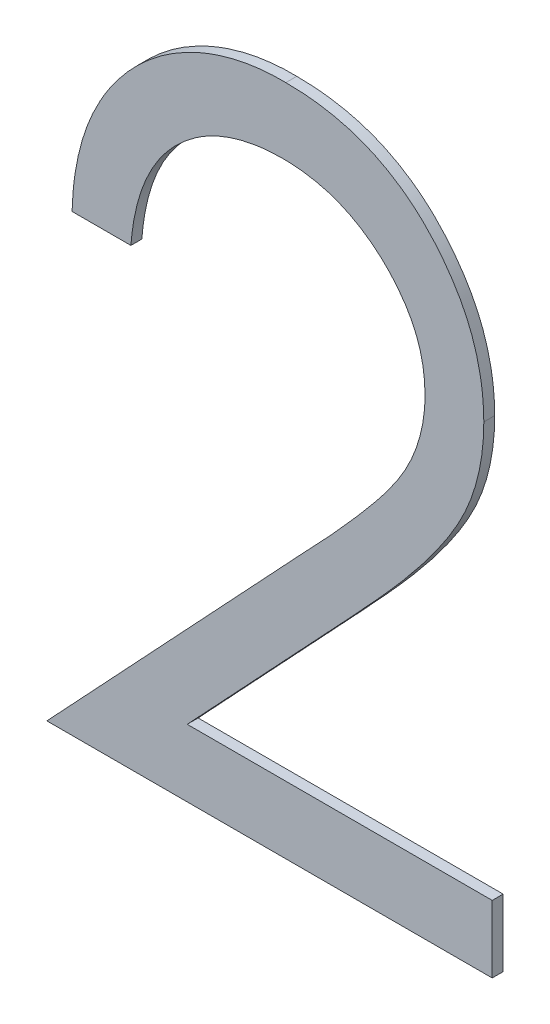
ISO-10303-21;
HEADER;
FILE_DESCRIPTION(('STEP AP214'),'2;1');
FILE_NAME('part.step','',(''),(''),'','','');
FILE_SCHEMA(('AUTOMOTIVE_DESIGN { 1 0 10303 214 1 1 1 1 }'));
ENDSEC;
DATA;
#1=APPLICATION_CONTEXT('core data for automotive mechanical design processes');
#2=APPLICATION_PROTOCOL_DEFINITION('international standard','automotive_design',2000,#1);
#3=PRODUCT_CONTEXT('',#1,'mechanical');
#4=PRODUCT('Part','Part','',(#3));
#5=PRODUCT_RELATED_PRODUCT_CATEGORY('part','',(#4));
#6=PRODUCT_DEFINITION_FORMATION('','',#4);
#7=PRODUCT_DEFINITION_CONTEXT('part definition',#1,'design');
#8=PRODUCT_DEFINITION('design','',#6,#7);
#9=PRODUCT_DEFINITION_SHAPE('','',#8);
#10=(LENGTH_UNIT() NAMED_UNIT(*) SI_UNIT(.MILLI.,.METRE.));
#11=(NAMED_UNIT(*) PLANE_ANGLE_UNIT() SI_UNIT($,.RADIAN.));
#12=(NAMED_UNIT(*) SI_UNIT($,.STERADIAN.) SOLID_ANGLE_UNIT());
#13=UNCERTAINTY_MEASURE_WITH_UNIT(LENGTH_MEASURE(1.E-05),#10,'distance_accuracy_value','');
#14=(GEOMETRIC_REPRESENTATION_CONTEXT(3) GLOBAL_UNCERTAINTY_ASSIGNED_CONTEXT((#13)) GLOBAL_UNIT_ASSIGNED_CONTEXT((#10,
#11,#12)) REPRESENTATION_CONTEXT('',''));
#15=CARTESIAN_POINT('',(0.,0.,0.));
#16=DIRECTION('',(0.,0.,1.));
#17=DIRECTION('',(1.,0.,0.));
#18=AXIS2_PLACEMENT_3D('',#15,#16,#17);
#19=CARTESIAN_POINT('',(0.484675480769231,0.914268571545005,0.551));
#20=CARTESIAN_POINT('',(0.484675480769231,0.914268571545005,0.55));
#21=CARTESIAN_POINT('',(0.484206266493408,0.914256313849051,0.551));
#22=CARTESIAN_POINT('',(0.484206266493408,0.914256313849051,0.55));
#23=CARTESIAN_POINT('',(0.483284807129645,0.91423224175812,0.551));
#24=CARTESIAN_POINT('',(0.483284807129645,0.91423224175812,0.55));
#25=CARTESIAN_POINT('',(0.481931909422161,0.914063853232542,0.551));
#26=CARTESIAN_POINT('',(0.481931909422161,0.914063853232542,0.55));
#27=CARTESIAN_POINT('',(0.48064129609318,0.913773353111452,0.551));
#28=CARTESIAN_POINT('',(0.48064129609318,0.913773353111452,0.55));
#29=CARTESIAN_POINT('',(0.479409720613987,0.913376038693388,0.551));
#30=CARTESIAN_POINT('',(0.479409720613987,0.913376038693388,0.55));
#31=CARTESIAN_POINT('',(0.478235099142912,0.912871034999291,0.551));
#32=CARTESIAN_POINT('',(0.478235099142912,0.912871034999291,0.55));
#33=CARTESIAN_POINT('',(0.477123144102272,0.912242033661941,0.551));
#34=CARTESIAN_POINT('',(0.477123144102272,0.912242033661941,0.55));
#35=CARTESIAN_POINT('',(0.476076351714959,0.911491459493612,0.551));
#36=CARTESIAN_POINT('',(0.476076351714959,0.911491459493612,0.55));
#37=CARTESIAN_POINT('',(0.475092754171894,0.910640478528057,0.551));
#38=CARTESIAN_POINT('',(0.475092754171894,0.910640478528057,0.55));
#39=CARTESIAN_POINT('',(0.474186514530805,0.909693033935784,0.551));
#40=CARTESIAN_POINT('',(0.474186514530805,0.909693033935784,0.55));
#41=CARTESIAN_POINT('',(0.47339028237312,0.90863686314035,0.551));
#42=CARTESIAN_POINT('',(0.47339028237312,0.90863686314035,0.55));
#43=CARTESIAN_POINT('',(0.472694556416373,0.907491250305418,0.551));
#44=CARTESIAN_POINT('',(0.472694556416373,0.907491250305418,0.55));
#45=CARTESIAN_POINT('',(0.47208754098529,0.906259286581371,0.550999999999999));
#46=CARTESIAN_POINT('',(0.47208754098529,0.906259286581371,0.549999999999999));
#47=CARTESIAN_POINT('',(0.471594586298157,0.904929793210208,0.551));
#48=CARTESIAN_POINT('',(0.471594586298157,0.904929793210208,0.55));
#49=CARTESIAN_POINT('',(0.471217903719338,0.90350748969852,0.551));
#50=CARTESIAN_POINT('',(0.471217903719338,0.90350748969852,0.55));
#51=CARTESIAN_POINT('',(0.470919843489825,0.901998551731002,0.551));
#52=CARTESIAN_POINT('',(0.470919843489825,0.901998551731002,0.55));
#53=CARTESIAN_POINT('',(0.470820268850884,0.90095652170489,0.551));
#54=CARTESIAN_POINT('',(0.470820268850884,0.90095652170489,0.55));
#55=CARTESIAN_POINT('',(0.470769230769231,0.900422417698851,0.551));
#56=CARTESIAN_POINT('',(0.470769230769231,0.900422417698851,0.55));
#57=B_SPLINE_SURFACE_WITH_KNOTS('',3,1,((#19,#20),(#21,#22),(#23,#24),(#25,#26),(#27,#28),(#29,
#30),(#31,#32),(#33,#34),(#35,#36),(#37,#38),(#39,#40),(#41,#42),(#43,#44),(#45,#46),(#47,#48),
(#49,#50),(#51,#52),(#53,#54),(#55,#56)),.UNSPECIFIED.,.F.,.F.,.F.,(4,1,1,1,1,1,1,1,1,1,1,1,1,1,
1,1,4),(2,2),(0.,0.0644386715952427,0.126546911271678,0.18688715343657,0.245877535589456,
0.304040884691268,0.362191218072659,0.420975932791646,0.480660283279666,0.540600274953759,
0.600689098349453,0.661935789757197,0.724442505913982,0.789038393881747,0.856313757050996,
0.926352028205863,1.),(0.,1.),.UNSPECIFIED.);
#58=CARTESIAN_POINT('',(0.484675480769231,0.914268571545005,0.549999999999998));
#59=CARTESIAN_POINT('',(0.484203213522581,0.914267831626176,0.549999999999998));
#60=CARTESIAN_POINT('',(0.483728933854455,0.9142480235491,0.549999999999998));
#61=CARTESIAN_POINT('',(0.481940146008268,0.914094619778343,0.549999999999998));
#62=CARTESIAN_POINT('',(0.480632701686934,0.91382124393103,0.549999999999999));
#63=CARTESIAN_POINT('',(0.478242592816631,0.91290938988838,0.549999999999999));
#64=CARTESIAN_POINT('',(0.477150992976622,0.91229475794108,0.549999999999999));
#65=CARTESIAN_POINT('',(0.475179069399388,0.910777096121196,0.549999999999999));
#66=CARTESIAN_POINT('',(0.474300320216442,0.909872025614639,0.549999999999999));
#67=CARTESIAN_POINT('',(0.472859067562755,0.907869027604336,0.550000000000001));
#68=CARTESIAN_POINT('',(0.472290285058833,0.906775570241275,0.550000000000002));
#69=CARTESIAN_POINT('',(0.471422518452948,0.904462672246368,0.550000000000002));
#70=CARTESIAN_POINT('',(0.471130491261301,0.903240800049967,0.550000000000002));
#71=CARTESIAN_POINT('',(0.470869153336606,0.901479061632357,0.550000000000003));
#72=CARTESIAN_POINT('',(0.470810823615498,0.900950547517057,0.550000000000004));
#73=CARTESIAN_POINT('',(0.470769230769231,0.90042241769885,0.550000000000004));
#74=B_SPLINE_CURVE_WITH_KNOTS('',3,(#58,#59,#60,#61,#62,#63,#64,#65,#66,#67,#68,#69,#70,#71,#72,
#73),.UNSPECIFIED.,.F.,.F.,(4,2,2,2,2,2,2,4),(0.,0.00142109215084824,0.00537166617766003,
0.00907573030699463,0.0128064111152645,0.0164584082801213,0.0201999460873375,
0.0217925649659397),.UNSPECIFIED.);
#75=CARTESIAN_POINT('',(0.484675480769231,0.914268571545005,0.55));
#76=VERTEX_POINT('',#75);
#77=CARTESIAN_POINT('',(0.470769230769231,0.900422417698851,0.55));
#78=VERTEX_POINT('',#77);
#79=EDGE_CURVE('E11',#76,#78,#74,.T.);
#80=DIRECTION('',(0.,0.,-1.));
#81=VECTOR('',#80,1.);
#82=CARTESIAN_POINT('',(0.484675480769231,0.914268571545005,0.551));
#83=LINE('',#82,#81);
#84=CARTESIAN_POINT('',(0.484675480769231,0.914268571545005,0.551));
#85=VERTEX_POINT('',#84);
#86=EDGE_CURVE('E223',#85,#76,#83,.T.);
#87=CARTESIAN_POINT('',(0.484675480769231,0.914268571545005,0.550999999999998));
#88=CARTESIAN_POINT('',(0.484203213522581,0.914267831626176,0.550999999999998));
#89=CARTESIAN_POINT('',(0.483728933854455,0.9142480235491,0.550999999999998));
#90=CARTESIAN_POINT('',(0.481940146008268,0.914094619778343,0.550999999999998));
#91=CARTESIAN_POINT('',(0.480632701686934,0.91382124393103,0.550999999999999));
#92=CARTESIAN_POINT('',(0.478242592816631,0.91290938988838,0.550999999999999));
#93=CARTESIAN_POINT('',(0.477150992976622,0.91229475794108,0.550999999999999));
#94=CARTESIAN_POINT('',(0.475179069399388,0.910777096121196,0.550999999999999));
#95=CARTESIAN_POINT('',(0.474300320216442,0.909872025614639,0.551));
#96=CARTESIAN_POINT('',(0.472859067562755,0.907869027604336,0.551));
#97=CARTESIAN_POINT('',(0.472290285058833,0.906775570241275,0.551));
#98=CARTESIAN_POINT('',(0.471422518452948,0.904462672246368,0.551000000000001));
#99=CARTESIAN_POINT('',(0.471130491261301,0.903240800049967,0.551000000000002));
#100=CARTESIAN_POINT('',(0.470869153336606,0.901479061632357,0.551000000000003));
#101=CARTESIAN_POINT('',(0.470810823615498,0.900950547517057,0.551000000000004));
#102=CARTESIAN_POINT('',(0.470769230769231,0.90042241769885,0.551000000000004));
#103=B_SPLINE_CURVE_WITH_KNOTS('',3,(#87,#88,#89,#90,#91,#92,#93,#94,#95,#96,#97,#98,#99,#100,
#101,#102),.UNSPECIFIED.,.F.,.F.,(4,2,2,2,2,2,2,4),(0.,0.00142109215084824,0.00537166617766003,
0.00907573030699463,0.0128064111152645,0.0164584082801213,0.0201999460873375,
0.0217925649659397),.UNSPECIFIED.);
#104=CARTESIAN_POINT('',(0.470769230769231,0.900422417698851,0.551));
#105=VERTEX_POINT('',#104);
#106=EDGE_CURVE('E228',#85,#105,#103,.T.);
#107=DIRECTION('',(0.,0.,-1.));
#108=VECTOR('',#107,1.);
#109=CARTESIAN_POINT('',(0.470769230769231,0.900422417698851,0.551));
#110=LINE('',#109,#108);
#111=EDGE_CURVE('E129',#105,#78,#110,.T.);
#112=ORIENTED_EDGE('',*,*,#79,.F.);
#113=ORIENTED_EDGE('',*,*,#86,.F.);
#114=ORIENTED_EDGE('',*,*,#106,.T.);
#115=ORIENTED_EDGE('',*,*,#111,.T.);
#116=EDGE_LOOP('',(#112,#113,#114,#115));
#117=FACE_BOUND('',#116,.T.);
#118=ADVANCED_FACE('F17',(#117),#57,.T.);
#119=CARTESIAN_POINT('',(0.497692307692308,0.902105110006543,0.551));
#120=CARTESIAN_POINT('',(0.497692307692308,0.902105110006543,0.55));
#121=CARTESIAN_POINT('',(0.497681409252889,0.902514505407871,0.551));
#122=CARTESIAN_POINT('',(0.497681409252889,0.902514505407871,0.55));
#123=CARTESIAN_POINT('',(0.497659930521605,0.90332134512835,0.551));
#124=CARTESIAN_POINT('',(0.497659930521605,0.90332134512835,0.55));
#125=CARTESIAN_POINT('',(0.49747036999314,0.904504300997242,0.551));
#126=CARTESIAN_POINT('',(0.49747036999314,0.904504300997242,0.55));
#127=CARTESIAN_POINT('',(0.497183904174377,0.905645412091226,0.551));
#128=CARTESIAN_POINT('',(0.497183904174377,0.905645412091226,0.55));
#129=CARTESIAN_POINT('',(0.496773414036412,0.906748188418961,0.551));
#130=CARTESIAN_POINT('',(0.496773414036412,0.906748188418961,0.55));
#131=CARTESIAN_POINT('',(0.496231584206378,0.907801542454381,0.551));
#132=CARTESIAN_POINT('',(0.496231584206378,0.907801542454381,0.55));
#133=CARTESIAN_POINT('',(0.495572040550647,0.908806756400728,0.551));
#134=CARTESIAN_POINT('',(0.495572040550647,0.908806756400728,0.55));
#135=CARTESIAN_POINT('',(0.494811068034913,0.90977856723273,0.551));
#136=CARTESIAN_POINT('',(0.494811068034913,0.90977856723273,0.55));
#137=CARTESIAN_POINT('',(0.493930760560669,0.910689766628011,0.551));
#138=CARTESIAN_POINT('',(0.493930760560669,0.910689766628011,0.55));
#139=CARTESIAN_POINT('',(0.492963705935413,0.911524301579138,0.551));
#140=CARTESIAN_POINT('',(0.492963705935413,0.911524301579138,0.55));
#141=CARTESIAN_POINT('',(0.491942090228238,0.912263571614814,0.551));
#142=CARTESIAN_POINT('',(0.491942090228238,0.912263571614814,0.55));
#143=CARTESIAN_POINT('',(0.490861231298068,0.912881384942793,0.551));
#144=CARTESIAN_POINT('',(0.490861231298068,0.912881384942793,0.55));
#145=CARTESIAN_POINT('',(0.489725686346483,0.913387844894458,0.551));
#146=CARTESIAN_POINT('',(0.489725686346483,0.913387844894458,0.55));
#147=CARTESIAN_POINT('',(0.488538621156625,0.913785137143538,0.551));
#148=CARTESIAN_POINT('',(0.488538621156625,0.913785137143538,0.55));
#149=CARTESIAN_POINT('',(0.48729773981167,0.914060427076506,0.551));
#150=CARTESIAN_POINT('',(0.48729773981167,0.914060427076506,0.55));
#151=CARTESIAN_POINT('',(0.486006470961113,0.914233269658448,0.551));
#152=CARTESIAN_POINT('',(0.486006470961113,0.914233269658448,0.55));
#153=CARTESIAN_POINT('',(0.48512475389213,0.914256655462591,0.551));
#154=CARTESIAN_POINT('',(0.48512475389213,0.914256655462591,0.55));
#155=CARTESIAN_POINT('',(0.484675480769231,0.914268571545005,0.551));
#156=CARTESIAN_POINT('',(0.484675480769231,0.914268571545005,0.55));
#157=B_SPLINE_SURFACE_WITH_KNOTS('',3,1,((#119,#120),(#121,#122),(#123,#124),(#125,#126),(#127,
#128),(#129,#130),(#131,#132),(#133,#134),(#135,#136),(#137,#138),(#139,#140),(#141,#142),(#143,
#144),(#145,#146),(#147,#148),(#149,#150),(#151,#152),(#153,#154),(#155,#156)),.UNSPECIFIED.,
.F.,.F.,.F.,(4,1,1,1,1,1,1,1,1,1,1,1,1,1,1,1,4),(2,2),(0.,0.0619654006870592,0.122121905638293,
0.180988496849838,0.2399332164519,0.299905831106523,0.359988847476984,0.421775741741647,
0.486575826421125,0.551534804619738,0.615017542759979,0.677258616661657,0.739729962362713,
0.803050102662949,0.866495132015698,0.931973474177148,1.),(0.,1.),.UNSPECIFIED.);
#158=CARTESIAN_POINT('',(0.497692307692308,0.902105110006543,0.550000000000003));
#159=CARTESIAN_POINT('',(0.497692501527364,0.902516974964914,0.550000000000003));
#160=CARTESIAN_POINT('',(0.497672377490097,0.902930660970146,0.550000000000003));
#161=CARTESIAN_POINT('',(0.497523116595974,0.904421018505221,0.550000000000003));
#162=CARTESIAN_POINT('',(0.49727041130824,0.905489414090464,0.550000000000002));
#163=CARTESIAN_POINT('',(0.496442124999117,0.907498531656379,0.550000000000001));
#164=CARTESIAN_POINT('',(0.495864125908815,0.908438231160685,0.550000000000001));
#165=CARTESIAN_POINT('',(0.494426013403723,0.910248801725126,0.549999999999999));
#166=CARTESIAN_POINT('',(0.493541015531758,0.911099166281303,0.549999999999999));
#167=CARTESIAN_POINT('',(0.491548616046052,0.912542452305651,0.549999999999999));
#168=CARTESIAN_POINT('',(0.490437356963885,0.913130250006775,0.55));
#169=CARTESIAN_POINT('',(0.488531186719328,0.913789630310478,0.549999999999999));
#170=CARTESIAN_POINT('',(0.487772424589085,0.91397191085067,0.549999999999998));
#171=CARTESIAN_POINT('',(0.486233163717163,0.914210583364619,0.549999999999997));
#172=CARTESIAN_POINT('',(0.485452623907423,0.914266718561469,0.549999999999997));
#173=CARTESIAN_POINT('',(0.484675480769231,0.914268571545005,0.549999999999998));
#174=B_SPLINE_CURVE_WITH_KNOTS('',3,(#158,#159,#160,#161,#162,#163,#164,#165,#166,#167,#168,
#169,#170,#171,#172,#173),.UNSPECIFIED.,.F.,.F.,(4,2,2,2,2,2,2,4),(0.,0.00123933239544057,
0.00448020756953758,0.00774549814606912,0.0113881694826965,0.0150991126148403,
0.0174292216016311,0.0197640693941652),.UNSPECIFIED.);
#175=CARTESIAN_POINT('',(0.497692307692308,0.902105110006543,0.55));
#176=VERTEX_POINT('',#175);
#177=EDGE_CURVE('E32',#176,#76,#174,.T.);
#178=DIRECTION('',(0.,0.,-1.));
#179=VECTOR('',#178,1.);
#180=CARTESIAN_POINT('',(0.497692307692308,0.902105110006543,0.551));
#181=LINE('',#180,#179);
#182=CARTESIAN_POINT('',(0.497692307692308,0.902105110006543,0.551));
#183=VERTEX_POINT('',#182);
#184=EDGE_CURVE('E226',#183,#176,#181,.T.);
#185=CARTESIAN_POINT('',(0.497692307692308,0.902105110006543,0.551000000000003));
#186=CARTESIAN_POINT('',(0.497692501527364,0.902516974964914,0.551000000000003));
#187=CARTESIAN_POINT('',(0.497672377490097,0.902930660970146,0.551000000000003));
#188=CARTESIAN_POINT('',(0.497523116595974,0.904421018505221,0.551000000000003));
#189=CARTESIAN_POINT('',(0.49727041130824,0.905489414090464,0.551000000000002));
#190=CARTESIAN_POINT('',(0.496442124999117,0.907498531656379,0.551000000000001));
#191=CARTESIAN_POINT('',(0.495864125908815,0.908438231160685,0.551));
#192=CARTESIAN_POINT('',(0.494426013403723,0.910248801725126,0.550999999999999));
#193=CARTESIAN_POINT('',(0.493541015531758,0.911099166281303,0.550999999999999));
#194=CARTESIAN_POINT('',(0.491548616046052,0.912542452305651,0.550999999999999));
#195=CARTESIAN_POINT('',(0.490437356963885,0.913130250006775,0.551));
#196=CARTESIAN_POINT('',(0.488531186719328,0.913789630310478,0.550999999999998));
#197=CARTESIAN_POINT('',(0.487772424589085,0.91397191085067,0.550999999999998));
#198=CARTESIAN_POINT('',(0.486233163717163,0.914210583364619,0.550999999999997));
#199=CARTESIAN_POINT('',(0.485452623907423,0.914266718561469,0.550999999999997));
#200=CARTESIAN_POINT('',(0.484675480769231,0.914268571545005,0.550999999999998));
#201=B_SPLINE_CURVE_WITH_KNOTS('',3,(#185,#186,#187,#188,#189,#190,#191,#192,#193,#194,#195,
#196,#197,#198,#199,#200),.UNSPECIFIED.,.F.,.F.,(4,2,2,2,2,2,2,4),(0.,0.00123933239544057,
0.00448020756953758,0.00774549814606912,0.0113881694826965,0.0150991126148403,
0.0174292216016311,0.0197640693941652),.UNSPECIFIED.);
#202=EDGE_CURVE('E242',#183,#85,#201,.T.);
#203=ORIENTED_EDGE('',*,*,#177,.F.);
#204=ORIENTED_EDGE('',*,*,#184,.F.);
#205=ORIENTED_EDGE('',*,*,#202,.T.);
#206=ORIENTED_EDGE('',*,*,#86,.T.);
#207=EDGE_LOOP('',(#203,#204,#205,#206));
#208=FACE_BOUND('',#207,.T.);
#209=ADVANCED_FACE('F187',(#208),#157,.T.);
#210=CARTESIAN_POINT('',(0.486346153846154,0.88371568692962,0.551));
#211=CARTESIAN_POINT('',(0.486346153846154,0.88371568692962,0.55));
#212=CARTESIAN_POINT('',(0.486912689048574,0.884307086470453,0.551));
#213=CARTESIAN_POINT('',(0.486912689048574,0.884307086470453,0.55));
#214=CARTESIAN_POINT('',(0.488000887227755,0.885443043955096,0.551));
#215=CARTESIAN_POINT('',(0.488000887227755,0.885443043955096,0.55));
#216=CARTESIAN_POINT('',(0.489540017115913,0.887101494700251,0.551));
#217=CARTESIAN_POINT('',(0.489540017115913,0.887101494700251,0.55));
#218=CARTESIAN_POINT('',(0.490922399772697,0.888640058256002,0.551));
#219=CARTESIAN_POINT('',(0.490922399772697,0.888640058256002,0.55));
#220=CARTESIAN_POINT('',(0.492156983648786,0.890055827657907,0.551));
#221=CARTESIAN_POINT('',(0.492156983648786,0.890055827657907,0.55));
#222=CARTESIAN_POINT('',(0.493216986597914,0.891369511677259,0.551));
#223=CARTESIAN_POINT('',(0.493216986597914,0.891369511677259,0.55));
#224=CARTESIAN_POINT('',(0.494157653431305,0.892538563738763,0.551));
#225=CARTESIAN_POINT('',(0.494157653431305,0.892538563738763,0.55));
#226=CARTESIAN_POINT('',(0.494911349276712,0.89361435431547,0.551));
#227=CARTESIAN_POINT('',(0.494911349276712,0.89361435431547,0.55));
#228=CARTESIAN_POINT('',(0.4957293274885,0.894861336268257,0.551));
#229=CARTESIAN_POINT('',(0.4957293274885,0.894861336268257,0.55));
#230=CARTESIAN_POINT('',(0.496521567169613,0.896383833134097,0.551));
#231=CARTESIAN_POINT('',(0.496521567169613,0.896383833134097,0.55));
#232=CARTESIAN_POINT('',(0.49720235041602,0.898244410664287,0.551));
#233=CARTESIAN_POINT('',(0.49720235041602,0.898244410664287,0.55));
#234=CARTESIAN_POINT('',(0.49761746210371,0.900159734995875,0.551));
#235=CARTESIAN_POINT('',(0.49761746210371,0.900159734995875,0.55));
#236=CARTESIAN_POINT('',(0.49766725928381,0.901454055630971,0.551));
#237=CARTESIAN_POINT('',(0.49766725928381,0.901454055630971,0.55));
#238=CARTESIAN_POINT('',(0.497692307692308,0.902105110006543,0.551));
#239=CARTESIAN_POINT('',(0.497692307692308,0.902105110006543,0.55));
#240=B_SPLINE_SURFACE_WITH_KNOTS('',3,1,((#210,#211),(#212,#213),(#214,#215),(#216,#217),(#218,
#219),(#220,#221),(#222,#223),(#224,#225),(#226,#227),(#228,#229),(#230,#231),(#232,#233),(#234,
#235),(#236,#237),(#238,#239)),.UNSPECIFIED.,.F.,.F.,.F.,(4,1,1,1,1,1,1,1,1,1,1,1,4),(2,2),(0.,
0.11080264380132,0.212829202347772,0.306101309823109,0.390647321116011,0.46692446936085,
0.534481039284029,0.593586940965671,0.644557004508715,0.736200452629371,0.825024025618862,
0.911985584829755,1.),(0.,1.),.UNSPECIFIED.);
#241=CARTESIAN_POINT('',(0.486346153846154,0.88371568692962,0.550000000000011));
#242=CARTESIAN_POINT('',(0.486920044619943,0.884310144241279,0.55000000000001));
#243=CARTESIAN_POINT('',(0.487490583033743,0.884908273797933,0.55000000000001));
#244=CARTESIAN_POINT('',(0.489851195257676,0.887422964414188,0.55000000000001));
#245=CARTESIAN_POINT('',(0.491598287526425,0.889381178586642,0.550000000000011));
#246=CARTESIAN_POINT('',(0.493503887133898,0.89172312577538,0.550000000000008));
#247=CARTESIAN_POINT('',(0.493752385386596,0.892032857802186,0.550000000000007));
#248=CARTESIAN_POINT('',(0.494236439175841,0.892666584095879,0.550000000000007));
#249=CARTESIAN_POINT('',(0.494471862706082,0.892990679306308,0.550000000000007));
#250=CARTESIAN_POINT('',(0.495159876369496,0.893975877235174,0.550000000000007));
#251=CARTESIAN_POINT('',(0.495594314550047,0.894650021014731,0.550000000000006));
#252=CARTESIAN_POINT('',(0.496676460358308,0.896665613870273,0.550000000000005));
#253=CARTESIAN_POINT('',(0.497190663235119,0.898086380482837,0.550000000000005));
#254=CARTESIAN_POINT('',(0.497624078061664,0.900391282967109,0.550000000000004));
#255=CARTESIAN_POINT('',(0.497702949077187,0.90124826500552,0.550000000000003));
#256=CARTESIAN_POINT('',(0.497692307692308,0.902105110006543,0.550000000000003));
#257=B_SPLINE_CURVE_WITH_KNOTS('',3,(#241,#242,#243,#244,#245,#246,#247,#248,#249,#250,#251,
#252,#253,#254,#255,#256),.UNSPECIFIED.,.F.,.F.,(4,2,2,2,2,2,2,4),(0.,0.00247951937552053,
0.010345046269058,0.0115360998947551,0.01273755676801,0.0151399731524818,0.0195885639286622,
0.0221558536454709),.UNSPECIFIED.);
#258=CARTESIAN_POINT('',(0.486346153846154,0.88371568692962,0.55));
#259=VERTEX_POINT('',#258);
#260=EDGE_CURVE('E212',#259,#176,#257,.T.);
#261=DIRECTION('',(0.,0.,-1.));
#262=VECTOR('',#261,1.);
#263=CARTESIAN_POINT('',(0.486346153846154,0.88371568692962,0.551));
#264=LINE('',#263,#262);
#265=CARTESIAN_POINT('',(0.486346153846154,0.88371568692962,0.551));
#266=VERTEX_POINT('',#265);
#267=EDGE_CURVE('E239',#266,#259,#264,.T.);
#268=CARTESIAN_POINT('',(0.486346153846154,0.88371568692962,0.551000000000011));
#269=CARTESIAN_POINT('',(0.486920044619943,0.884310144241279,0.55100000000001));
#270=CARTESIAN_POINT('',(0.487490583033743,0.884908273797933,0.55100000000001));
#271=CARTESIAN_POINT('',(0.489851195257676,0.887422964414188,0.551000000000009));
#272=CARTESIAN_POINT('',(0.491598287526425,0.889381178586642,0.55100000000001));
#273=CARTESIAN_POINT('',(0.493503887133898,0.89172312577538,0.551000000000008));
#274=CARTESIAN_POINT('',(0.493752385386596,0.892032857802186,0.551000000000007));
#275=CARTESIAN_POINT('',(0.494236439175841,0.892666584095879,0.551000000000007));
#276=CARTESIAN_POINT('',(0.494471862706082,0.892990679306308,0.551000000000007));
#277=CARTESIAN_POINT('',(0.495159876369496,0.893975877235174,0.551000000000007));
#278=CARTESIAN_POINT('',(0.495594314550047,0.894650021014731,0.551000000000006));
#279=CARTESIAN_POINT('',(0.496676460358308,0.896665613870273,0.551000000000005));
#280=CARTESIAN_POINT('',(0.497190663235119,0.898086380482837,0.551000000000004));
#281=CARTESIAN_POINT('',(0.497624078061664,0.900391282967109,0.551000000000004));
#282=CARTESIAN_POINT('',(0.497702949077187,0.90124826500552,0.551000000000003));
#283=CARTESIAN_POINT('',(0.497692307692308,0.902105110006543,0.551000000000003));
#284=B_SPLINE_CURVE_WITH_KNOTS('',3,(#268,#269,#270,#271,#272,#273,#274,#275,#276,#277,#278,
#279,#280,#281,#282,#283),.UNSPECIFIED.,.F.,.F.,(4,2,2,2,2,2,2,4),(0.,0.00247951937552053,
0.010345046269058,0.0115360998947551,0.01273755676801,0.0151399731524818,0.0195885639286622,
0.0221558536454709),.UNSPECIFIED.);
#285=EDGE_CURVE('E255',#266,#183,#284,.T.);
#286=ORIENTED_EDGE('',*,*,#260,.F.);
#287=ORIENTED_EDGE('',*,*,#267,.F.);
#288=ORIENTED_EDGE('',*,*,#285,.T.);
#289=ORIENTED_EDGE('',*,*,#184,.T.);
#290=EDGE_LOOP('',(#286,#287,#288,#289));
#291=FACE_BOUND('',#290,.T.);
#292=ADVANCED_FACE('F183',(#291),#240,.T.);
#293=CARTESIAN_POINT('',(0.463076923076923,0.858883956160389,0.551));
#294=DIRECTION('',(-0.729691385153424,0.683776631973394,0.));
#295=DIRECTION('',(-0.683776631973394,-0.729691385153424,0.));
#296=AXIS2_PLACEMENT_3D('',#293,#294,#295);
#297=PLANE('',#296);
#298=DIRECTION('',(0.683776631973394,0.729691385153423,0.));
#299=VECTOR('',#298,1.);
#300=CARTESIAN_POINT('',(0.463076923076923,0.858883956160389,0.55));
#301=LINE('',#300,#299);
#302=CARTESIAN_POINT('',(0.463076923076923,0.858883956160389,0.55));
#303=VERTEX_POINT('',#302);
#304=EDGE_CURVE('E231',#303,#259,#301,.T.);
#305=ORIENTED_EDGE('',*,*,#304,.F.);
#306=DIRECTION('',(0.,0.,-1.));
#307=VECTOR('',#306,1.);
#308=CARTESIAN_POINT('',(0.463076923076923,0.858883956160389,0.551));
#309=LINE('',#308,#307);
#310=CARTESIAN_POINT('',(0.463076923076923,0.858883956160389,0.551));
#311=VERTEX_POINT('',#310);
#312=EDGE_CURVE('E252',#311,#303,#309,.T.);
#313=ORIENTED_EDGE('',*,*,#312,.F.);
#314=DIRECTION('',(0.683776631973394,0.729691385153423,0.));
#315=VECTOR('',#314,1.);
#316=CARTESIAN_POINT('',(0.463076923076923,0.858883956160389,0.551));
#317=LINE('',#316,#315);
#318=EDGE_CURVE('E267',#311,#266,#317,.T.);
#319=ORIENTED_EDGE('',*,*,#318,.T.);
#320=ORIENTED_EDGE('',*,*,#267,.T.);
#321=EDGE_LOOP('',(#305,#313,#319,#320));
#322=FACE_BOUND('',#321,.T.);
#323=ADVANCED_FACE('F329',(#322),#297,.T.);
#324=CARTESIAN_POINT('',(0.503846153846154,0.858883956160389,0.551));
#325=DIRECTION('',(0.,-1.,0.));
#326=DIRECTION('',(0.,0.,-1.));
#327=AXIS2_PLACEMENT_3D('',#324,#325,#326);
#328=PLANE('',#327);
#329=DIRECTION('',(-1.,0.,0.));
#330=VECTOR('',#329,1.);
#331=CARTESIAN_POINT('',(0.503846153846154,0.858883956160389,0.55));
#332=LINE('',#331,#330);
#333=CARTESIAN_POINT('',(0.503846153846154,0.858883956160389,0.55));
#334=VERTEX_POINT('',#333);
#335=EDGE_CURVE('E249',#334,#303,#332,.T.);
#336=ORIENTED_EDGE('',*,*,#335,.F.);
#337=DIRECTION('',(-1.11022302462503E-13,0.,-1.));
#338=VECTOR('',#337,1.);
#339=CARTESIAN_POINT('',(0.503846153846154,0.858883956160389,0.551));
#340=LINE('',#339,#338);
#341=CARTESIAN_POINT('',(0.503846153846154,0.858883956160389,0.551));
#342=VERTEX_POINT('',#341);
#343=EDGE_CURVE('E264',#342,#334,#340,.T.);
#344=ORIENTED_EDGE('',*,*,#343,.F.);
#345=DIRECTION('',(-1.,0.,0.));
#346=VECTOR('',#345,1.);
#347=CARTESIAN_POINT('',(0.503846153846154,0.858883956160389,0.551));
#348=LINE('',#347,#346);
#349=EDGE_CURVE('E276',#342,#311,#348,.T.);
#350=ORIENTED_EDGE('',*,*,#349,.T.);
#351=ORIENTED_EDGE('',*,*,#312,.T.);
#352=EDGE_LOOP('',(#336,#344,#350,#351));
#353=FACE_BOUND('',#352,.T.);
#354=ADVANCED_FACE('F309',(#353),#328,.T.);
#355=CARTESIAN_POINT('',(0.503846153846154,0.865037802314235,0.551));
#356=DIRECTION('',(1.,0.,0.));
#357=DIRECTION('',(0.,0.,-1.));
#358=AXIS2_PLACEMENT_3D('',#355,#356,#357);
#359=PLANE('',#358);
#360=DIRECTION('',(0.,-1.,0.));
#361=VECTOR('',#360,1.);
#362=CARTESIAN_POINT('',(0.503846153846154,0.865037802314235,0.55));
#363=LINE('',#362,#361);
#364=CARTESIAN_POINT('',(0.503846153846154,0.865037802314235,0.55));
#365=VERTEX_POINT('',#364);
#366=EDGE_CURVE('E261',#365,#334,#363,.T.);
#367=ORIENTED_EDGE('',*,*,#366,.F.);
#368=DIRECTION('',(-1.11022302462503E-13,-1.11022302462503E-13,-1.));
#369=VECTOR('',#368,1.);
#370=CARTESIAN_POINT('',(0.503846153846154,0.865037802314235,0.551));
#371=LINE('',#370,#369);
#372=CARTESIAN_POINT('',(0.503846153846154,0.865037802314235,0.551));
#373=VERTEX_POINT('',#372);
#374=EDGE_CURVE('E273',#373,#365,#371,.T.);
#375=ORIENTED_EDGE('',*,*,#374,.F.);
#376=DIRECTION('',(0.,-1.,0.));
#377=VECTOR('',#376,1.);
#378=CARTESIAN_POINT('',(0.503846153846154,0.865037802314235,0.551));
#379=LINE('',#378,#377);
#380=EDGE_CURVE('E284',#373,#342,#379,.T.);
#381=ORIENTED_EDGE('',*,*,#380,.T.);
#382=ORIENTED_EDGE('',*,*,#343,.T.);
#383=EDGE_LOOP('',(#367,#375,#381,#382));
#384=FACE_BOUND('',#383,.T.);
#385=ADVANCED_FACE('F310',(#384),#359,.T.);
#386=CARTESIAN_POINT('',(0.475925480769231,0.865037802314235,0.551));
#387=DIRECTION('',(0.,1.,0.));
#388=DIRECTION('',(0.,0.,1.));
#389=AXIS2_PLACEMENT_3D('',#386,#387,#388);
#390=PLANE('',#389);
#391=DIRECTION('',(1.,0.,0.));
#392=VECTOR('',#391,1.);
#393=CARTESIAN_POINT('',(0.475925480769231,0.865037802314235,0.55));
#394=LINE('',#393,#392);
#395=CARTESIAN_POINT('',(0.475925480769231,0.865037802314235,0.55));
#396=VERTEX_POINT('',#395);
#397=EDGE_CURVE('E270',#396,#365,#394,.T.);
#398=ORIENTED_EDGE('',*,*,#397,.F.);
#399=DIRECTION('',(0.,-1.11022302462503E-13,-1.));
#400=VECTOR('',#399,1.);
#401=CARTESIAN_POINT('',(0.475925480769231,0.865037802314235,0.551));
#402=LINE('',#401,#400);
#403=CARTESIAN_POINT('',(0.475925480769231,0.865037802314235,0.551));
#404=VERTEX_POINT('',#403);
#405=EDGE_CURVE('E282',#404,#396,#402,.T.);
#406=ORIENTED_EDGE('',*,*,#405,.F.);
#407=DIRECTION('',(1.,0.,0.));
#408=VECTOR('',#407,1.);
#409=CARTESIAN_POINT('',(0.475925480769231,0.865037802314235,0.551));
#410=LINE('',#409,#408);
#411=EDGE_CURVE('E293',#404,#373,#410,.T.);
#412=ORIENTED_EDGE('',*,*,#411,.T.);
#413=ORIENTED_EDGE('',*,*,#374,.T.);
#414=EDGE_LOOP('',(#398,#406,#412,#413));
#415=FACE_BOUND('',#414,.T.);
#416=ADVANCED_FACE('F311',(#415),#390,.T.);
#417=CARTESIAN_POINT('',(0.4909375,0.88105943692962,0.551));
#418=DIRECTION('',(0.729724964678346,-0.683740795861405,0.));
#419=DIRECTION('',(0.683740795861405,0.729724964678346,0.));
#420=AXIS2_PLACEMENT_3D('',#417,#418,#419);
#421=PLANE('',#420);
#422=DIRECTION('',(-0.683740795861406,-0.729724964678345,0.));
#423=VECTOR('',#422,1.);
#424=CARTESIAN_POINT('',(0.4909375,0.88105943692962,0.55));
#425=LINE('',#424,#423);
#426=CARTESIAN_POINT('',(0.4909375,0.88105943692962,0.55));
#427=VERTEX_POINT('',#426);
#428=EDGE_CURVE('E279',#427,#396,#425,.T.);
#429=ORIENTED_EDGE('',*,*,#428,.F.);
#430=DIRECTION('',(0.,0.,-1.));
#431=VECTOR('',#430,1.);
#432=CARTESIAN_POINT('',(0.4909375,0.88105943692962,0.551));
#433=LINE('',#432,#431);
#434=CARTESIAN_POINT('',(0.4909375,0.88105943692962,0.551));
#435=VERTEX_POINT('',#434);
#436=EDGE_CURVE('E290',#435,#427,#433,.T.);
#437=ORIENTED_EDGE('',*,*,#436,.F.);
#438=DIRECTION('',(-0.683740795861406,-0.729724964678345,0.));
#439=VECTOR('',#438,1.);
#440=CARTESIAN_POINT('',(0.4909375,0.88105943692962,0.551));
#441=LINE('',#440,#439);
#442=EDGE_CURVE('E174',#435,#404,#441,.T.);
#443=ORIENTED_EDGE('',*,*,#442,.T.);
#444=ORIENTED_EDGE('',*,*,#405,.T.);
#445=EDGE_LOOP('',(#429,#437,#443,#444));
#446=FACE_BOUND('',#445,.T.);
#447=ADVANCED_FACE('F305',(#446),#421,.T.);
#448=CARTESIAN_POINT('',(0.503076923076923,0.902585879237312,0.551));
#449=CARTESIAN_POINT('',(0.503076923076923,0.902585879237312,0.55));
#450=CARTESIAN_POINT('',(0.503047895713669,0.901750202073173,0.551));
#451=CARTESIAN_POINT('',(0.503047895713669,0.901750202073173,0.55));
#452=CARTESIAN_POINT('',(0.502990350376289,0.900093512695964,0.551));
#453=CARTESIAN_POINT('',(0.502990350376289,0.900093512695964,0.55));
#454=CARTESIAN_POINT('',(0.502498103920848,0.897658972191691,0.551));
#455=CARTESIAN_POINT('',(0.502498103920848,0.897658972191691,0.55));
#456=CARTESIAN_POINT('',(0.501729306587783,0.895300227864492,0.551));
#457=CARTESIAN_POINT('',(0.501729306587783,0.895300227864492,0.55));
#458=CARTESIAN_POINT('',(0.500803637613223,0.893401874114473,0.551));
#459=CARTESIAN_POINT('',(0.500803637613223,0.893401874114473,0.55));
#460=CARTESIAN_POINT('',(0.499869824286451,0.891872157078637,0.551));
#461=CARTESIAN_POINT('',(0.499869824286451,0.891872157078637,0.55));
#462=CARTESIAN_POINT('',(0.499028324156275,0.890612693565728,0.551));
#463=CARTESIAN_POINT('',(0.499028324156275,0.890612693565728,0.55));
#464=CARTESIAN_POINT('',(0.498043213110186,0.889256599821909,0.551));
#465=CARTESIAN_POINT('',(0.498043213110186,0.889256599821909,0.55));
#466=CARTESIAN_POINT('',(0.496900153145111,0.887808416895499,0.551));
#467=CARTESIAN_POINT('',(0.496900153145111,0.887808416895499,0.55));
#468=CARTESIAN_POINT('',(0.495622789622527,0.886256801379523,0.551));
#469=CARTESIAN_POINT('',(0.495622789622527,0.886256801379523,0.55));
#470=CARTESIAN_POINT('',(0.494199552536414,0.884602690601265,0.551));
#471=CARTESIAN_POINT('',(0.494199552536414,0.884602690601265,0.55));
#472=CARTESIAN_POINT('',(0.492620292844618,0.882863174547207,0.551));
#473=CARTESIAN_POINT('',(0.492620292844618,0.882863174547207,0.55));
#474=CARTESIAN_POINT('',(0.491511861403115,0.881675078523416,0.551));
#475=CARTESIAN_POINT('',(0.491511861403115,0.881675078523416,0.55));
#476=CARTESIAN_POINT('',(0.4909375,0.88105943692962,0.551));
#477=CARTESIAN_POINT('',(0.4909375,0.88105943692962,0.55));
#478=B_SPLINE_SURFACE_WITH_KNOTS('',3,1,((#448,#449),(#450,#451),(#452,#453),(#454,#455),(#456,
#457),(#458,#459),(#460,#461),(#462,#463),(#464,#465),(#466,#467),(#468,#469),(#470,#471),(#472,
#473),(#474,#475),(#476,#477)),.UNSPECIFIED.,.F.,.F.,.F.,(4,1,1,1,1,1,1,1,1,1,1,1,4),(2,2),(0.,
0.0987021963061524,0.195672308810664,0.292422426507955,0.391342543799822,0.444462440671893,
0.504228775449318,0.570352337994679,0.642545753097747,0.722287505344019,0.807921122682712,
0.900469537985015,1.),(0.,1.),.UNSPECIFIED.);
#479=CARTESIAN_POINT('',(0.503076923076923,0.902585879237312,0.550000000000003));
#480=CARTESIAN_POINT('',(0.503077869668552,0.901745107595195,0.550000000000003));
#481=CARTESIAN_POINT('',(0.503025049096264,0.900900398899101,0.550000000000004));
#482=CARTESIAN_POINT('',(0.502709624786572,0.898433982294413,0.550000000000005));
#483=CARTESIAN_POINT('',(0.502296506242322,0.896828212855463,0.550000000000005));
#484=CARTESIAN_POINT('',(0.50095620014688,0.893573935188434,0.550000000000007));
#485=CARTESIAN_POINT('',(0.499960972803972,0.891955399378348,0.550000000000007));
#486=CARTESIAN_POINT('',(0.497471522980966,0.888418430822435,0.550000000000009));
#487=CARTESIAN_POINT('',(0.495916398578366,0.886550017112283,0.550000000000009));
#488=CARTESIAN_POINT('',(0.493198264035569,0.883492352970134,0.550000000000011));
#489=CARTESIAN_POINT('',(0.492067059948194,0.882275421035635,0.550000000000011));
#490=CARTESIAN_POINT('',(0.4909375,0.88105943692962,0.550000000000012));
#491=B_SPLINE_CURVE_WITH_KNOTS('',3,(#479,#480,#481,#482,#483,#484,#485,#486,#487,#488,#489,
#490),.UNSPECIFIED.,.F.,.F.,(4,2,2,2,2,4),(0.,0.00252943373673182,0.00743632660646668,
0.0130820801310514,0.0203727668032334,0.0253543529753716),.UNSPECIFIED.);
#492=CARTESIAN_POINT('',(0.503076923076923,0.902585879237312,0.55));
#493=VERTEX_POINT('',#492);
#494=EDGE_CURVE('E204',#493,#427,#491,.T.);
#495=DIRECTION('',(0.,0.,-1.));
#496=VECTOR('',#495,1.);
#497=CARTESIAN_POINT('',(0.503076923076923,0.902585879237312,0.551));
#498=LINE('',#497,#496);
#499=CARTESIAN_POINT('',(0.503076923076923,0.902585879237312,0.551));
#500=VERTEX_POINT('',#499);
#501=EDGE_CURVE('E299',#500,#493,#498,.T.);
#502=CARTESIAN_POINT('',(0.503076923076923,0.902585879237312,0.551000000000003));
#503=CARTESIAN_POINT('',(0.503077869668552,0.901745107595195,0.551000000000003));
#504=CARTESIAN_POINT('',(0.503025049096264,0.900900398899101,0.551000000000004));
#505=CARTESIAN_POINT('',(0.502709624786572,0.898433982294413,0.551000000000005));
#506=CARTESIAN_POINT('',(0.502296506242322,0.896828212855463,0.551000000000005));
#507=CARTESIAN_POINT('',(0.50095620014688,0.893573935188434,0.551000000000007));
#508=CARTESIAN_POINT('',(0.499960972803972,0.891955399378348,0.551000000000007));
#509=CARTESIAN_POINT('',(0.497471522980966,0.888418430822435,0.551000000000009));
#510=CARTESIAN_POINT('',(0.495916398578366,0.886550017112283,0.55100000000001));
#511=CARTESIAN_POINT('',(0.493198264035569,0.883492352970134,0.551000000000011));
#512=CARTESIAN_POINT('',(0.492067059948194,0.882275421035635,0.551000000000012));
#513=CARTESIAN_POINT('',(0.4909375,0.88105943692962,0.551000000000012));
#514=B_SPLINE_CURVE_WITH_KNOTS('',3,(#502,#503,#504,#505,#506,#507,#508,#509,#510,#511,#512,
#513),.UNSPECIFIED.,.F.,.F.,(4,2,2,2,2,4),(0.,0.00252943373673182,0.00743632660646668,
0.0130820801310514,0.0203727668032334,0.0253543529753716),.UNSPECIFIED.);
#515=EDGE_CURVE('E335',#500,#435,#514,.T.);
#516=ORIENTED_EDGE('',*,*,#494,.F.);
#517=ORIENTED_EDGE('',*,*,#501,.F.);
#518=ORIENTED_EDGE('',*,*,#515,.T.);
#519=ORIENTED_EDGE('',*,*,#436,.T.);
#520=EDGE_LOOP('',(#516,#517,#518,#519));
#521=FACE_BOUND('',#520,.T.);
#522=ADVANCED_FACE('F319',(#521),#478,.T.);
#523=CARTESIAN_POINT('',(0.484951923076923,0.920422417698851,0.551));
#524=CARTESIAN_POINT('',(0.484951923076923,0.920422417698851,0.55));
#525=CARTESIAN_POINT('',(0.485609832918421,0.920407015588358,0.551));
#526=CARTESIAN_POINT('',(0.485609832918421,0.920407015588358,0.55));
#527=CARTESIAN_POINT('',(0.486902602255388,0.920376750991426,0.551));
#528=CARTESIAN_POINT('',(0.486902602255388,0.920376750991426,0.55));
#529=CARTESIAN_POINT('',(0.488789379646008,0.920116847632559,0.551));
#530=CARTESIAN_POINT('',(0.488789379646008,0.920116847632559,0.55));
#531=CARTESIAN_POINT('',(0.490585561836809,0.919709780347383,0.551));
#532=CARTESIAN_POINT('',(0.490585561836809,0.919709780347383,0.55));
#533=CARTESIAN_POINT('',(0.492287637834328,0.919138658924869,0.551));
#534=CARTESIAN_POINT('',(0.492287637834328,0.919138658924869,0.55));
#535=CARTESIAN_POINT('',(0.493882027512692,0.918370925883855,0.551));
#536=CARTESIAN_POINT('',(0.493882027512692,0.918370925883855,0.55));
#537=CARTESIAN_POINT('',(0.495380708276515,0.917448682364001,0.551));
#538=CARTESIAN_POINT('',(0.495380708276515,0.917448682364001,0.55));
#539=CARTESIAN_POINT('',(0.49680152217579,0.916382056683335,0.551));
#540=CARTESIAN_POINT('',(0.49680152217579,0.916382056683335,0.55));
#541=CARTESIAN_POINT('',(0.498080495609141,0.91512627702422,0.551));
#542=CARTESIAN_POINT('',(0.498080495609141,0.91512627702422,0.55));
#543=CARTESIAN_POINT('',(0.499254919824619,0.913785664719014,0.551));
#544=CARTESIAN_POINT('',(0.499254919824619,0.913785664719014,0.55));
#545=CARTESIAN_POINT('',(0.500268101341378,0.912354443514234,0.551));
#546=CARTESIAN_POINT('',(0.500268101341378,0.912354443514234,0.55));
#547=CARTESIAN_POINT('',(0.50113575557235,0.91087622718769,0.551));
#548=CARTESIAN_POINT('',(0.50113575557235,0.91087622718769,0.55));
#549=CARTESIAN_POINT('',(0.501858972941742,0.909339743732008,0.551));
#550=CARTESIAN_POINT('',(0.501858972941742,0.909339743732008,0.55));
#551=CARTESIAN_POINT('',(0.502391363894984,0.907730526102075,0.551));
#552=CARTESIAN_POINT('',(0.502391363894984,0.907730526102075,0.55));
#553=CARTESIAN_POINT('',(0.502795561746916,0.906072002625648,0.551));
#554=CARTESIAN_POINT('',(0.502795561746916,0.906072002625648,0.55));
#555=CARTESIAN_POINT('',(0.503024031695854,0.904347005865535,0.551));
#556=CARTESIAN_POINT('',(0.503024031695854,0.904347005865535,0.55));
#557=CARTESIAN_POINT('',(0.503059096098675,0.903179464911574,0.551));
#558=CARTESIAN_POINT('',(0.503059096098675,0.903179464911574,0.55));
#559=CARTESIAN_POINT('',(0.503076923076923,0.902585879237312,0.551));
#560=CARTESIAN_POINT('',(0.503076923076923,0.902585879237312,0.55));
#561=B_SPLINE_SURFACE_WITH_KNOTS('',3,1,((#523,#524),(#525,#526),(#527,#528),(#529,#530),(#531,
#532),(#533,#534),(#535,#536),(#537,#538),(#539,#540),(#541,#542),(#543,#544),(#545,#546),(#547,
#548),(#549,#550),(#551,#552),(#553,#554),(#555,#556),(#557,#558),(#559,#560)),.UNSPECIFIED.,
.F.,.F.,.F.,(4,1,1,1,1,1,1,1,1,1,1,1,1,1,1,1,4),(2,2),(0.,0.06947546024967,0.1365167976178,
0.200788823609261,0.263829672855825,0.325735022965421,0.387290692215292,0.449509218762603,
0.512967819545443,0.576275215493062,0.637580100263927,0.697902605917101,0.757172088426985,
0.816598528488655,0.876653170892819,0.937289642410241,1.),(0.,1.),.UNSPECIFIED.);
#562=CARTESIAN_POINT('',(0.484951923076923,0.920422417698851,0.549999999999996));
#563=CARTESIAN_POINT('',(0.485613328544929,0.920421957897919,0.549999999999996));
#564=CARTESIAN_POINT('',(0.486278397892007,0.92039451176961,0.549999999999996));
#565=CARTESIAN_POINT('',(0.488774509174081,0.92017717849519,0.549999999999996));
#566=CARTESIAN_POINT('',(0.490596146009876,0.91978633405408,0.549999999999996));
#567=CARTESIAN_POINT('',(0.493818945052167,0.918476105021158,0.549999999999996));
#568=CARTESIAN_POINT('',(0.495244282834898,0.917618640069099,0.549999999999997));
#569=CARTESIAN_POINT('',(0.497526081271538,0.915737223148691,0.549999999999999));
#570=CARTESIAN_POINT('',(0.498439270758131,0.914778201512031,0.549999999999999));
#571=CARTESIAN_POINT('',(0.500293555848654,0.912409578680008,0.549999999999999));
#572=CARTESIAN_POINT('',(0.501172213465391,0.910948768617115,0.55));
#573=CARTESIAN_POINT('',(0.502424218235184,0.907851306653262,0.55));
#574=CARTESIAN_POINT('',(0.50280591642877,0.906218073209458,0.550000000000001));
#575=CARTESIAN_POINT('',(0.50304243016634,0.903908975677601,0.550000000000002));
#576=CARTESIAN_POINT('',(0.503075919502815,0.903246009751349,0.550000000000003));
#577=CARTESIAN_POINT('',(0.503076923076923,0.902585879237312,0.550000000000003));
#578=B_SPLINE_CURVE_WITH_KNOTS('',3,(#562,#563,#564,#565,#566,#567,#568,#569,#570,#571,#572,
#573,#574,#575,#576,#577),.UNSPECIFIED.,.F.,.F.,(4,2,2,2,2,2,2,4),(0.,0.00199196825414417,
0.00749216899132813,0.0123958498066358,0.0163446815523366,0.0213881643660162,0.0263457520798237,
0.0283319765065227),.UNSPECIFIED.);
#579=CARTESIAN_POINT('',(0.484951923076923,0.920422417698851,0.55));
#580=VERTEX_POINT('',#579);
#581=EDGE_CURVE('E196',#580,#493,#578,.T.);
#582=DIRECTION('',(0.,0.,-1.));
#583=VECTOR('',#582,1.);
#584=CARTESIAN_POINT('',(0.484951923076923,0.920422417698851,0.551));
#585=LINE('',#584,#583);
#586=CARTESIAN_POINT('',(0.484951923076923,0.920422417698851,0.551));
#587=VERTEX_POINT('',#586);
#588=EDGE_CURVE('E175',#587,#580,#585,.T.);
#589=CARTESIAN_POINT('',(0.484951923076923,0.920422417698851,0.550999999999996));
#590=CARTESIAN_POINT('',(0.485613328544929,0.920421957897919,0.550999999999996));
#591=CARTESIAN_POINT('',(0.486278397892007,0.92039451176961,0.550999999999996));
#592=CARTESIAN_POINT('',(0.488774509174081,0.92017717849519,0.550999999999996));
#593=CARTESIAN_POINT('',(0.490596146009876,0.91978633405408,0.550999999999996));
#594=CARTESIAN_POINT('',(0.493818945052167,0.918476105021158,0.550999999999996));
#595=CARTESIAN_POINT('',(0.495244282834898,0.917618640069099,0.550999999999996));
#596=CARTESIAN_POINT('',(0.497526081271538,0.915737223148691,0.550999999999997));
#597=CARTESIAN_POINT('',(0.498439270758131,0.914778201512031,0.550999999999998));
#598=CARTESIAN_POINT('',(0.500293555848654,0.912409578680008,0.551));
#599=CARTESIAN_POINT('',(0.501172213465391,0.910948768617115,0.551));
#600=CARTESIAN_POINT('',(0.502424218235184,0.907851306653262,0.551));
#601=CARTESIAN_POINT('',(0.50280591642877,0.906218073209458,0.551000000000001));
#602=CARTESIAN_POINT('',(0.50304243016634,0.903908975677601,0.551000000000002));
#603=CARTESIAN_POINT('',(0.503075919502815,0.903246009751349,0.551000000000003));
#604=CARTESIAN_POINT('',(0.503076923076923,0.902585879237312,0.551000000000003));
#605=B_SPLINE_CURVE_WITH_KNOTS('',3,(#589,#590,#591,#592,#593,#594,#595,#596,#597,#598,#599,
#600,#601,#602,#603,#604),.UNSPECIFIED.,.F.,.F.,(4,2,2,2,2,2,2,4),(0.,0.00199196825414417,
0.00749216899132813,0.0123958498066358,0.0163446815523366,0.0213881643660162,0.0263457520798237,
0.0283319765065227),.UNSPECIFIED.);
#606=EDGE_CURVE('E123',#587,#500,#605,.T.);
#607=ORIENTED_EDGE('',*,*,#581,.F.);
#608=ORIENTED_EDGE('',*,*,#588,.F.);
#609=ORIENTED_EDGE('',*,*,#606,.T.);
#610=ORIENTED_EDGE('',*,*,#501,.T.);
#611=EDGE_LOOP('',(#607,#608,#609,#610));
#612=FACE_BOUND('',#611,.T.);
#613=ADVANCED_FACE('F156',(#612),#561,.T.);
#614=CARTESIAN_POINT('',(0.465384615384616,0.900422417698851,0.551));
#615=CARTESIAN_POINT('',(0.465384615384616,0.900422417698851,0.55));
#616=CARTESIAN_POINT('',(0.46541970943618,0.90113677577487,0.551));
#617=CARTESIAN_POINT('',(0.46541970943618,0.90113677577487,0.55));
#618=CARTESIAN_POINT('',(0.465488633219483,0.902539756024726,0.551));
#619=CARTESIAN_POINT('',(0.465488633219483,0.902539756024726,0.55));
#620=CARTESIAN_POINT('',(0.465811403892542,0.904585308705852,0.551));
#621=CARTESIAN_POINT('',(0.465811403892542,0.904585308705852,0.55));
#622=CARTESIAN_POINT('',(0.466273247501768,0.906540533826851,0.551));
#623=CARTESIAN_POINT('',(0.466273247501768,0.906540533826851,0.55));
#624=CARTESIAN_POINT('',(0.466926243856307,0.908389732352045,0.551));
#625=CARTESIAN_POINT('',(0.466926243856307,0.908389732352045,0.55));
#626=CARTESIAN_POINT('',(0.467737208618075,0.910149254761707,0.551));
#627=CARTESIAN_POINT('',(0.467737208618075,0.910149254761707,0.55));
#628=CARTESIAN_POINT('',(0.468709723373176,0.911812112173558,0.551));
#629=CARTESIAN_POINT('',(0.468709723373176,0.911812112173558,0.55));
#630=CARTESIAN_POINT('',(0.469861617953406,0.913371961122951,0.551));
#631=CARTESIAN_POINT('',(0.469861617953406,0.913371961122951,0.55));
#632=CARTESIAN_POINT('',(0.47116801910847,0.91481434129373,0.551));
#633=CARTESIAN_POINT('',(0.47116801910847,0.91481434129373,0.55));
#634=CARTESIAN_POINT('',(0.472586910063699,0.916137556793147,0.551));
#635=CARTESIAN_POINT('',(0.472586910063699,0.916137556793147,0.55));
#636=CARTESIAN_POINT('',(0.47411786902606,0.917280218098396,0.551));
#637=CARTESIAN_POINT('',(0.47411786902606,0.917280218098396,0.55));
#638=CARTESIAN_POINT('',(0.475726640922396,0.918245663893173,0.551));
#639=CARTESIAN_POINT('',(0.475726640922396,0.918245663893173,0.55));
#640=CARTESIAN_POINT('',(0.477408344904661,0.919052770895867,0.551));
#641=CARTESIAN_POINT('',(0.477408344904661,0.919052770895867,0.55));
#642=CARTESIAN_POINT('',(0.47918195456568,0.919658596825968,0.551));
#643=CARTESIAN_POINT('',(0.47918195456568,0.919658596825968,0.55));
#644=CARTESIAN_POINT('',(0.481031374985784,0.920108110647761,0.551));
#645=CARTESIAN_POINT('',(0.481031374985784,0.920108110647761,0.55));
#646=CARTESIAN_POINT('',(0.482964731609946,0.920378562288702,0.551));
#647=CARTESIAN_POINT('',(0.482964731609946,0.920378562288702,0.55));
#648=CARTESIAN_POINT('',(0.484281989130751,0.920407632899062,0.551));
#649=CARTESIAN_POINT('',(0.484281989130751,0.920407632899062,0.55));
#650=CARTESIAN_POINT('',(0.484951923076923,0.920422417698851,0.551));
#651=CARTESIAN_POINT('',(0.484951923076923,0.920422417698851,0.55));
#652=B_SPLINE_SURFACE_WITH_KNOTS('',3,1,((#614,#615),(#616,#617),(#618,#619),(#620,#621),(#622,
#623),(#624,#625),(#626,#627),(#628,#629),(#630,#631),(#632,#633),(#634,#635),(#636,#637),(#638,
#639),(#640,#641),(#642,#643),(#644,#645),(#646,#647),(#648,#649),(#650,#651)),.UNSPECIFIED.,
.F.,.F.,.F.,(4,1,1,1,1,1,1,1,1,1,1,1,1,1,1,1,4),(2,2),(0.,0.0687907943906177,0.135103289431125,
0.198978674310649,0.261904299780854,0.323494969367968,0.38519537796605,0.446969238740772,
0.50976477670313,0.572250568847367,0.633405175661153,0.693251162921753,0.752583162785669,
0.81257926615342,0.873275084920191,0.935549942895029,1.),(0.,1.),.UNSPECIFIED.);
#653=CARTESIAN_POINT('',(0.465384615384616,0.900422417698851,0.550000000000004));
#654=CARTESIAN_POINT('',(0.465403700685635,0.901141664478489,0.550000000000004));
#655=CARTESIAN_POINT('',(0.465451667947523,0.901863210131012,0.550000000000003));
#656=CARTESIAN_POINT('',(0.465750886474349,0.904575827691492,0.550000000000002));
#657=CARTESIAN_POINT('',(0.466211734094936,0.906551108217887,0.550000000000001));
#658=CARTESIAN_POINT('',(0.467689412488955,0.910188993760761,0.549999999999999));
#659=CARTESIAN_POINT('',(0.468682147806231,0.911861229755222,0.549999999999999));
#660=CARTESIAN_POINT('',(0.471092805016399,0.914843533260505,0.549999999999999));
#661=CARTESIAN_POINT('',(0.472507337772395,0.916156333312914,0.549999999999998));
#662=CARTESIAN_POINT('',(0.475590975325812,0.91823512433445,0.549999999999996));
#663=CARTESIAN_POINT('',(0.477243871888816,0.919025114208293,0.549999999999996));
#664=CARTESIAN_POINT('',(0.480903494092056,0.920171330022548,0.549999999999996));
#665=CARTESIAN_POINT('',(0.482929075834,0.920467857007766,0.549999999999996));
#666=CARTESIAN_POINT('',(0.484951923076923,0.920422417698851,0.549999999999996));
#667=B_SPLINE_CURVE_WITH_KNOTS('',3,(#653,#654,#655,#656,#657,#658,#659,#660,#661,#662,#663,
#664,#665,#666),.UNSPECIFIED.,.F.,.F.,(4,2,2,2,2,2,4),(0.,0.00216492968127427,
0.00816569455180056,0.0139151212986123,0.0196195422638973,0.0250395593095674,
0.0310773095970212),.UNSPECIFIED.);
#668=CARTESIAN_POINT('',(0.465384615384616,0.900422417698851,0.55));
#669=VERTEX_POINT('',#668);
#670=EDGE_CURVE('E118',#669,#580,#667,.T.);
#671=DIRECTION('',(0.,0.,-1.));
#672=VECTOR('',#671,1.);
#673=CARTESIAN_POINT('',(0.465384615384616,0.900422417698851,0.551));
#674=LINE('',#673,#672);
#675=CARTESIAN_POINT('',(0.465384615384616,0.900422417698851,0.551));
#676=VERTEX_POINT('',#675);
#677=EDGE_CURVE('E110',#676,#669,#674,.T.);
#678=CARTESIAN_POINT('',(0.465384615384616,0.900422417698851,0.551000000000004));
#679=CARTESIAN_POINT('',(0.465403700685635,0.901141664478489,0.551000000000004));
#680=CARTESIAN_POINT('',(0.465451667947523,0.901863210131012,0.551000000000003));
#681=CARTESIAN_POINT('',(0.465750886474349,0.904575827691492,0.551000000000002));
#682=CARTESIAN_POINT('',(0.466211734094936,0.906551108217887,0.551000000000001));
#683=CARTESIAN_POINT('',(0.467689412488955,0.910188993760761,0.550999999999999));
#684=CARTESIAN_POINT('',(0.468682147806231,0.911861229755222,0.550999999999999));
#685=CARTESIAN_POINT('',(0.471092805016399,0.914843533260505,0.550999999999998));
#686=CARTESIAN_POINT('',(0.472507337772395,0.916156333312914,0.550999999999998));
#687=CARTESIAN_POINT('',(0.475590975325812,0.91823512433445,0.550999999999996));
#688=CARTESIAN_POINT('',(0.477243871888816,0.919025114208293,0.550999999999996));
#689=CARTESIAN_POINT('',(0.480903494092056,0.920171330022548,0.550999999999996));
#690=CARTESIAN_POINT('',(0.482929075834,0.920467857007766,0.550999999999996));
#691=CARTESIAN_POINT('',(0.484951923076923,0.920422417698851,0.550999999999996));
#692=B_SPLINE_CURVE_WITH_KNOTS('',3,(#678,#679,#680,#681,#682,#683,#684,#685,#686,#687,#688,
#689,#690,#691),.UNSPECIFIED.,.F.,.F.,(4,2,2,2,2,2,4),(0.,0.00216492968127427,
0.00816569455180056,0.0139151212986123,0.0196195422638973,0.0250395593095674,
0.0310773095970212),.UNSPECIFIED.);
#693=EDGE_CURVE('E115',#676,#587,#692,.T.);
#694=ORIENTED_EDGE('',*,*,#670,.F.);
#695=ORIENTED_EDGE('',*,*,#677,.F.);
#696=ORIENTED_EDGE('',*,*,#693,.T.);
#697=ORIENTED_EDGE('',*,*,#588,.T.);
#698=EDGE_LOOP('',(#694,#695,#696,#697));
#699=FACE_BOUND('',#698,.T.);
#700=ADVANCED_FACE('F112',(#699),#652,.T.);
#701=CARTESIAN_POINT('',(0.470769230769231,0.900422417698851,0.551));
#702=DIRECTION('',(0.,-1.,0.));
#703=DIRECTION('',(0.,0.,-1.));
#704=AXIS2_PLACEMENT_3D('',#701,#702,#703);
#705=PLANE('',#704);
#706=DIRECTION('',(-1.,0.,0.));
#707=VECTOR('',#706,1.);
#708=CARTESIAN_POINT('',(0.470769230769231,0.900422417698851,0.55));
#709=LINE('',#708,#707);
#710=EDGE_CURVE('E122',#78,#669,#709,.T.);
#711=ORIENTED_EDGE('',*,*,#710,.F.);
#712=ORIENTED_EDGE('',*,*,#111,.F.);
#713=DIRECTION('',(-1.,0.,0.));
#714=VECTOR('',#713,1.);
#715=CARTESIAN_POINT('',(0.470769230769231,0.900422417698851,0.551));
#716=LINE('',#715,#714);
#717=EDGE_CURVE('E127',#105,#676,#716,.T.);
#718=ORIENTED_EDGE('',*,*,#717,.T.);
#719=ORIENTED_EDGE('',*,*,#677,.T.);
#720=EDGE_LOOP('',(#711,#712,#718,#719));
#721=FACE_BOUND('',#720,.T.);
#722=ADVANCED_FACE('F128',(#721),#705,.T.);
#723=CARTESIAN_POINT('',(0.47480651503508,0.910330706091938,0.551));
#724=DIRECTION('',(0.,-8.14910251587989E-13,-1.));
#725=DIRECTION('',(0.,1.,-8.14910251587989E-13));
#726=AXIS2_PLACEMENT_3D('',#723,#724,#725);
#727=PLANE('',#726);
#728=ORIENTED_EDGE('',*,*,#106,.F.);
#729=ORIENTED_EDGE('',*,*,#202,.F.);
#730=ORIENTED_EDGE('',*,*,#285,.F.);
#731=ORIENTED_EDGE('',*,*,#318,.F.);
#732=ORIENTED_EDGE('',*,*,#349,.F.);
#733=ORIENTED_EDGE('',*,*,#380,.F.);
#734=ORIENTED_EDGE('',*,*,#411,.F.);
#735=ORIENTED_EDGE('',*,*,#442,.F.);
#736=ORIENTED_EDGE('',*,*,#515,.F.);
#737=ORIENTED_EDGE('',*,*,#606,.F.);
#738=ORIENTED_EDGE('',*,*,#693,.F.);
#739=ORIENTED_EDGE('',*,*,#717,.F.);
#740=EDGE_LOOP('',(#728,#729,#730,#731,#732,#733,#734,#735,#736,#737,#738,#739));
#741=FACE_BOUND('',#740,.T.);
#742=ADVANCED_FACE('F133',(#741),#727,.F.);
#743=CARTESIAN_POINT('',(0.47480651503508,0.910330706091938,0.55));
#744=DIRECTION('',(0.,-8.14910251587989E-13,-1.));
#745=DIRECTION('',(0.,1.,-8.14910251587989E-13));
#746=AXIS2_PLACEMENT_3D('',#743,#744,#745);
#747=PLANE('',#746);
#748=ORIENTED_EDGE('',*,*,#79,.T.);
#749=ORIENTED_EDGE('',*,*,#710,.T.);
#750=ORIENTED_EDGE('',*,*,#670,.T.);
#751=ORIENTED_EDGE('',*,*,#581,.T.);
#752=ORIENTED_EDGE('',*,*,#494,.T.);
#753=ORIENTED_EDGE('',*,*,#428,.T.);
#754=ORIENTED_EDGE('',*,*,#397,.T.);
#755=ORIENTED_EDGE('',*,*,#366,.T.);
#756=ORIENTED_EDGE('',*,*,#335,.T.);
#757=ORIENTED_EDGE('',*,*,#304,.T.);
#758=ORIENTED_EDGE('',*,*,#260,.T.);
#759=ORIENTED_EDGE('',*,*,#177,.T.);
#760=EDGE_LOOP('',(#748,#749,#750,#751,#752,#753,#754,#755,#756,#757,#758,#759));
#761=FACE_BOUND('',#760,.T.);
#762=ADVANCED_FACE('F178',(#761),#747,.T.);
#763=CLOSED_SHELL('',(#118,#209,#292,#323,#354,#385,#416,#447,#522,#613,#700,#722,#742,#762));
#764=MANIFOLD_SOLID_BREP('B1',#763);
#765=ADVANCED_BREP_SHAPE_REPRESENTATION('',(#18,#764),#14);
#766=SHAPE_DEFINITION_REPRESENTATION(#9,#765);
ENDSEC;
END-ISO-10303-21;
